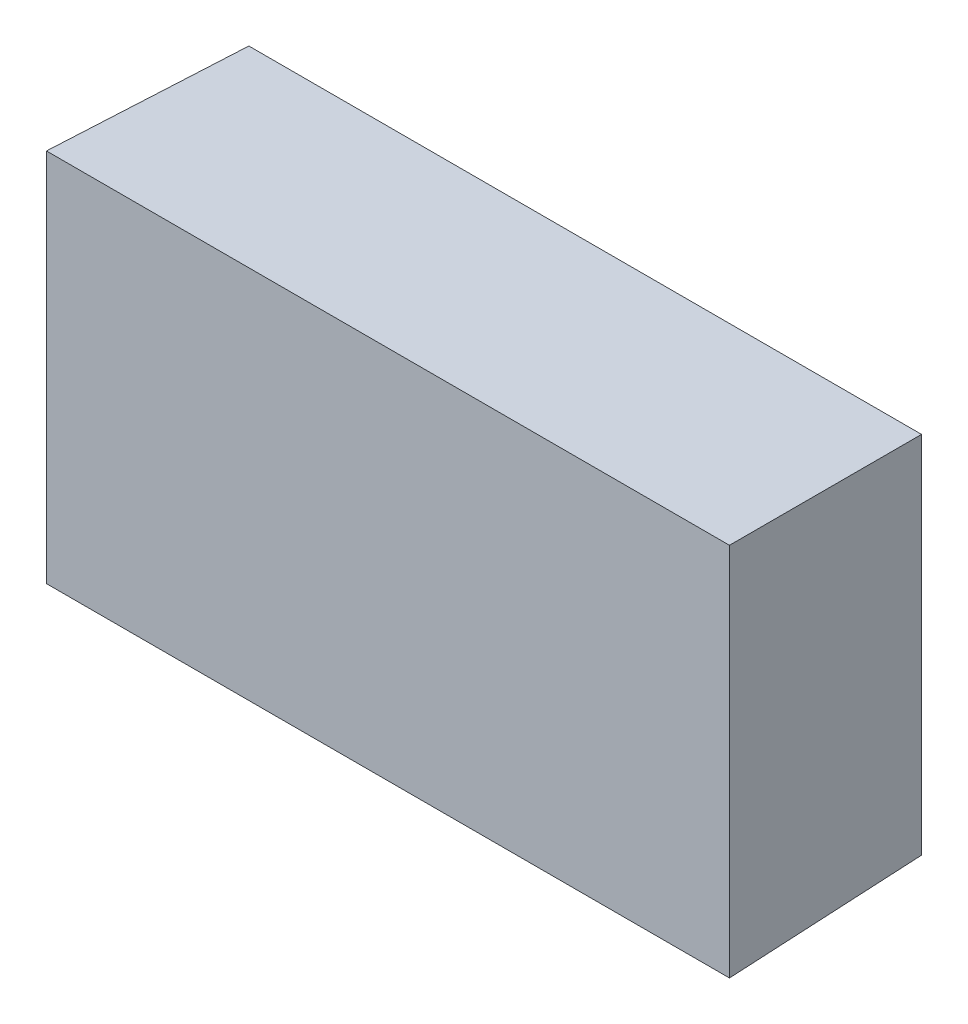
ISO-10303-21;
HEADER;
FILE_DESCRIPTION(('STEP AP214'),'2;1');
FILE_NAME('part.step','',(''),(''),'','','');
FILE_SCHEMA(('AUTOMOTIVE_DESIGN { 1 0 10303 214 1 1 1 1 }'));
ENDSEC;
DATA;
#1=APPLICATION_CONTEXT('core data for automotive mechanical design processes');
#2=APPLICATION_PROTOCOL_DEFINITION('international standard','automotive_design',2000,#1);
#3=PRODUCT_CONTEXT('',#1,'mechanical');
#4=PRODUCT('Part','Part','',(#3));
#5=PRODUCT_RELATED_PRODUCT_CATEGORY('part','',(#4));
#6=PRODUCT_DEFINITION_FORMATION('','',#4);
#7=PRODUCT_DEFINITION_CONTEXT('part definition',#1,'design');
#8=PRODUCT_DEFINITION('design','',#6,#7);
#9=PRODUCT_DEFINITION_SHAPE('','',#8);
#10=(LENGTH_UNIT() NAMED_UNIT(*) SI_UNIT(.MILLI.,.METRE.));
#11=(NAMED_UNIT(*) PLANE_ANGLE_UNIT() SI_UNIT($,.RADIAN.));
#12=(NAMED_UNIT(*) SI_UNIT($,.STERADIAN.) SOLID_ANGLE_UNIT());
#13=UNCERTAINTY_MEASURE_WITH_UNIT(LENGTH_MEASURE(1.E-05),#10,'distance_accuracy_value','');
#14=(GEOMETRIC_REPRESENTATION_CONTEXT(3) GLOBAL_UNCERTAINTY_ASSIGNED_CONTEXT((#13)) GLOBAL_UNIT_ASSIGNED_CONTEXT((#10,
#11,#12)) REPRESENTATION_CONTEXT('',''));
#15=CARTESIAN_POINT('',(0.,0.,0.));
#16=DIRECTION('',(0.,0.,1.));
#17=DIRECTION('',(1.,0.,0.));
#18=AXIS2_PLACEMENT_3D('',#15,#16,#17);
#19=CARTESIAN_POINT('',(60.6,-33.25,0.));
#20=DIRECTION('',(0.999657324975557,0.,-0.0261769483078695));
#21=DIRECTION('',(-0.0261769483078695,0.,-0.999657324975557));
#22=AXIS2_PLACEMENT_3D('',#19,#20,#21);
#23=PLANE('',#22);
#24=DIRECTION('',(0.,1.,0.));
#25=VECTOR('',#24,1.);
#26=CARTESIAN_POINT('',(60.6,-33.25,0.));
#27=LINE('',#26,#25);
#28=CARTESIAN_POINT('',(60.6,-33.25,0.));
#29=VERTEX_POINT('',#28);
#30=CARTESIAN_POINT('',(60.6,33.25,0.));
#31=VERTEX_POINT('',#30);
#32=EDGE_CURVE('E87',#29,#31,#27,.T.);
#33=ORIENTED_EDGE('',*,*,#32,.F.);
#34=DIRECTION('',(0.0261679842649757,-0.0261679842649757,0.99931500198837));
#35=VECTOR('',#34,1.);
#36=CARTESIAN_POINT('',(60.5170066758604,-33.1670066758604,-3.16938718083164));
#37=LINE('',#36,#35);
#38=CARTESIAN_POINT('',(59.6834927450786,-32.3334927450786,-35.));
#39=VERTEX_POINT('',#38);
#40=EDGE_CURVE('E11',#39,#29,#37,.T.);
#41=ORIENTED_EDGE('',*,*,#40,.F.);
#42=DIRECTION('',(0.,1.,0.));
#43=VECTOR('',#42,1.);
#44=CARTESIAN_POINT('',(59.6834927450786,0.,-35.));
#45=LINE('',#44,#43);
#46=CARTESIAN_POINT('',(59.6834927450786,32.3334927450786,-35.));
#47=VERTEX_POINT('',#46);
#48=EDGE_CURVE('E89',#39,#47,#45,.T.);
#49=ORIENTED_EDGE('',*,*,#48,.T.);
#50=DIRECTION('',(0.0261679842649757,0.0261679842649757,0.99931500198837));
#51=VECTOR('',#50,1.);
#52=CARTESIAN_POINT('',(60.5544632338673,33.2044632338673,-1.73897893997776));
#53=LINE('',#52,#51);
#54=EDGE_CURVE('E74',#47,#31,#53,.T.);
#55=ORIENTED_EDGE('',*,*,#54,.T.);
#56=EDGE_LOOP('',(#33,#41,#49,#55));
#57=FACE_BOUND('',#56,.T.);
#58=ADVANCED_FACE('F37',(#57),#23,.T.);
#59=CARTESIAN_POINT('',(-60.6,-33.25,0.));
#60=DIRECTION('',(0.,-0.999657324975557,-0.0261769483078695));
#61=DIRECTION('',(0.,0.0261769483078695,-0.999657324975557));
#62=AXIS2_PLACEMENT_3D('',#59,#60,#61);
#63=PLANE('',#62);
#64=DIRECTION('',(1.,0.,0.));
#65=VECTOR('',#64,1.);
#66=CARTESIAN_POINT('',(-60.6,-33.25,0.));
#67=LINE('',#66,#65);
#68=CARTESIAN_POINT('',(-60.6,-33.25,0.));
#69=VERTEX_POINT('',#68);
#70=EDGE_CURVE('E99',#69,#29,#67,.T.);
#71=ORIENTED_EDGE('',*,*,#70,.F.);
#72=DIRECTION('',(-0.0261679842649757,-0.0261679842649757,0.99931500198837));
#73=VECTOR('',#72,1.);
#74=CARTESIAN_POINT('',(-60.5544632338672,-33.2044632338673,-1.73897893997776));
#75=LINE('',#74,#73);
#76=CARTESIAN_POINT('',(-59.6834927450785,-32.3334927450786,-35.));
#77=VERTEX_POINT('',#76);
#78=EDGE_CURVE('E47',#77,#69,#75,.T.);
#79=ORIENTED_EDGE('',*,*,#78,.F.);
#80=DIRECTION('',(1.,0.,0.));
#81=VECTOR('',#80,1.);
#82=CARTESIAN_POINT('',(0.,-32.3334927450786,-35.));
#83=LINE('',#82,#81);
#84=EDGE_CURVE('E90',#77,#39,#83,.T.);
#85=ORIENTED_EDGE('',*,*,#84,.T.);
#86=ORIENTED_EDGE('',*,*,#40,.T.);
#87=EDGE_LOOP('',(#71,#79,#85,#86));
#88=FACE_BOUND('',#87,.T.);
#89=ADVANCED_FACE('F39',(#88),#63,.T.);
#90=CARTESIAN_POINT('',(-60.6,33.25,0.));
#91=DIRECTION('',(-0.999657324975557,0.,-0.0261769483078695));
#92=DIRECTION('',(-0.0261769483078695,0.,0.999657324975557));
#93=AXIS2_PLACEMENT_3D('',#90,#91,#92);
#94=PLANE('',#93);
#95=DIRECTION('',(0.,-1.,0.));
#96=VECTOR('',#95,1.);
#97=CARTESIAN_POINT('',(-60.6,33.25,0.));
#98=LINE('',#97,#96);
#99=CARTESIAN_POINT('',(-60.6,33.25,0.));
#100=VERTEX_POINT('',#99);
#101=EDGE_CURVE('E96',#100,#69,#98,.T.);
#102=ORIENTED_EDGE('',*,*,#101,.F.);
#103=DIRECTION('',(-0.0261679842649757,0.0261679842649757,0.99931500198837));
#104=VECTOR('',#103,1.);
#105=CARTESIAN_POINT('',(-60.5170066758603,33.1670066758604,-3.16938718083164));
#106=LINE('',#105,#104);
#107=CARTESIAN_POINT('',(-59.6834927450786,32.3334927450786,-35.));
#108=VERTEX_POINT('',#107);
#109=EDGE_CURVE('E67',#108,#100,#106,.T.);
#110=ORIENTED_EDGE('',*,*,#109,.F.);
#111=DIRECTION('',(0.,-1.,0.));
#112=VECTOR('',#111,1.);
#113=CARTESIAN_POINT('',(-59.6834927450786,0.,-35.));
#114=LINE('',#113,#112);
#115=EDGE_CURVE('E107',#108,#77,#114,.T.);
#116=ORIENTED_EDGE('',*,*,#115,.T.);
#117=ORIENTED_EDGE('',*,*,#78,.T.);
#118=EDGE_LOOP('',(#102,#110,#116,#117));
#119=FACE_BOUND('',#118,.T.);
#120=ADVANCED_FACE('F112',(#119),#94,.T.);
#121=CARTESIAN_POINT('',(60.6,33.25,0.));
#122=DIRECTION('',(0.,0.999657324975557,-0.0261769483078695));
#123=DIRECTION('',(0.,0.0261769483078695,0.999657324975557));
#124=AXIS2_PLACEMENT_3D('',#121,#122,#123);
#125=PLANE('',#124);
#126=DIRECTION('',(-1.,0.,0.));
#127=VECTOR('',#126,1.);
#128=CARTESIAN_POINT('',(60.6,33.25,0.));
#129=LINE('',#128,#127);
#130=EDGE_CURVE('E93',#31,#100,#129,.T.);
#131=ORIENTED_EDGE('',*,*,#130,.F.);
#132=ORIENTED_EDGE('',*,*,#54,.F.);
#133=DIRECTION('',(-1.,0.,0.));
#134=VECTOR('',#133,1.);
#135=CARTESIAN_POINT('',(0.,32.3334927450786,-35.));
#136=LINE('',#135,#134);
#137=EDGE_CURVE('E41',#47,#108,#136,.T.);
#138=ORIENTED_EDGE('',*,*,#137,.T.);
#139=ORIENTED_EDGE('',*,*,#109,.T.);
#140=EDGE_LOOP('',(#131,#132,#138,#139));
#141=FACE_BOUND('',#140,.T.);
#142=ADVANCED_FACE('F94',(#141),#125,.T.);
#143=CARTESIAN_POINT('',(0.,0.,-35.));
#144=DIRECTION('',(0.,0.,1.));
#145=DIRECTION('',(1.,0.,0.));
#146=AXIS2_PLACEMENT_3D('',#143,#144,#145);
#147=PLANE('',#146);
#148=ORIENTED_EDGE('',*,*,#48,.F.);
#149=ORIENTED_EDGE('',*,*,#84,.F.);
#150=ORIENTED_EDGE('',*,*,#115,.F.);
#151=ORIENTED_EDGE('',*,*,#137,.F.);
#152=EDGE_LOOP('',(#148,#149,#150,#151));
#153=FACE_BOUND('',#152,.T.);
#154=ADVANCED_FACE('F110',(#153),#147,.F.);
#155=CARTESIAN_POINT('',(0.,0.,0.));
#156=DIRECTION('',(0.,0.,1.));
#157=DIRECTION('',(1.,0.,0.));
#158=AXIS2_PLACEMENT_3D('',#155,#156,#157);
#159=PLANE('',#158);
#160=ORIENTED_EDGE('',*,*,#32,.T.);
#161=ORIENTED_EDGE('',*,*,#130,.T.);
#162=ORIENTED_EDGE('',*,*,#101,.T.);
#163=ORIENTED_EDGE('',*,*,#70,.T.);
#164=EDGE_LOOP('',(#160,#161,#162,#163));
#165=FACE_BOUND('',#164,.T.);
#166=ADVANCED_FACE('F98',(#165),#159,.T.);
#167=CLOSED_SHELL('',(#58,#89,#120,#142,#154,#166));
#168=MANIFOLD_SOLID_BREP('B2',#167);
#169=ADVANCED_BREP_SHAPE_REPRESENTATION('',(#18,#168),#14);
#170=SHAPE_DEFINITION_REPRESENTATION(#9,#169);
ENDSEC;
END-ISO-10303-21;
